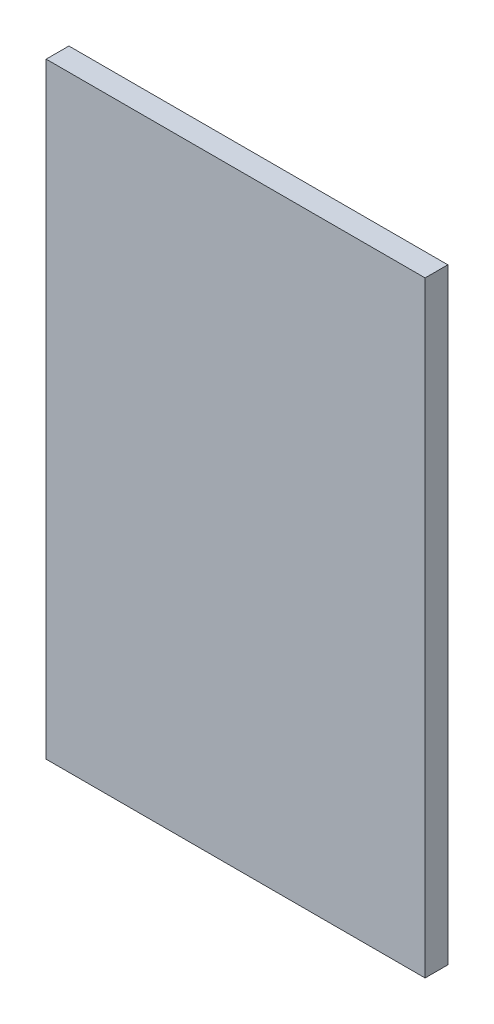
ISO-10303-21;
HEADER;
FILE_DESCRIPTION(('STEP AP214'),'2;1');
FILE_NAME('part.step','',(''),(''),'','','');
FILE_SCHEMA(('AUTOMOTIVE_DESIGN { 1 0 10303 214 1 1 1 1 }'));
ENDSEC;
DATA;
#1=APPLICATION_CONTEXT('core data for automotive mechanical design processes');
#2=APPLICATION_PROTOCOL_DEFINITION('international standard','automotive_design',2000,#1);
#3=PRODUCT_CONTEXT('',#1,'mechanical');
#4=PRODUCT('Part','Part','',(#3));
#5=PRODUCT_RELATED_PRODUCT_CATEGORY('part','',(#4));
#6=PRODUCT_DEFINITION_FORMATION('','',#4);
#7=PRODUCT_DEFINITION_CONTEXT('part definition',#1,'design');
#8=PRODUCT_DEFINITION('design','',#6,#7);
#9=PRODUCT_DEFINITION_SHAPE('','',#8);
#10=(LENGTH_UNIT() NAMED_UNIT(*) SI_UNIT(.MILLI.,.METRE.));
#11=(NAMED_UNIT(*) PLANE_ANGLE_UNIT() SI_UNIT($,.RADIAN.));
#12=(NAMED_UNIT(*) SI_UNIT($,.STERADIAN.) SOLID_ANGLE_UNIT());
#13=UNCERTAINTY_MEASURE_WITH_UNIT(LENGTH_MEASURE(1.E-05),#10,'distance_accuracy_value','');
#14=(GEOMETRIC_REPRESENTATION_CONTEXT(3) GLOBAL_UNCERTAINTY_ASSIGNED_CONTEXT((#13)) GLOBAL_UNIT_ASSIGNED_CONTEXT((#10,
#11,#12)) REPRESENTATION_CONTEXT('',''));
#15=CARTESIAN_POINT('',(0.,0.,0.));
#16=DIRECTION('',(0.,0.,1.));
#17=DIRECTION('',(1.,0.,0.));
#18=AXIS2_PLACEMENT_3D('',#15,#16,#17);
#19=CARTESIAN_POINT('',(250.,800.,-15.));
#20=DIRECTION('',(-1.,0.,0.));
#21=DIRECTION('',(0.,0.,1.));
#22=AXIS2_PLACEMENT_3D('',#19,#20,#21);
#23=PLANE('',#22);
#24=DIRECTION('',(0.,0.,-1.));
#25=VECTOR('',#24,1.);
#26=CARTESIAN_POINT('',(250.,0.,-15.));
#27=LINE('',#26,#25);
#28=CARTESIAN_POINT('',(250.,0.,15.));
#29=VERTEX_POINT('',#28);
#30=CARTESIAN_POINT('',(250.,0.,-15.));
#31=VERTEX_POINT('',#30);
#32=EDGE_CURVE('E102',#29,#31,#27,.T.);
#33=ORIENTED_EDGE('',*,*,#32,.T.);
#34=DIRECTION('',(0.,-1.,0.));
#35=VECTOR('',#34,1.);
#36=CARTESIAN_POINT('',(250.,800.,-15.));
#37=LINE('',#36,#35);
#38=CARTESIAN_POINT('',(250.,800.,-15.));
#39=VERTEX_POINT('',#38);
#40=EDGE_CURVE('E11',#39,#31,#37,.T.);
#41=ORIENTED_EDGE('',*,*,#40,.F.);
#42=DIRECTION('',(0.,0.,-1.));
#43=VECTOR('',#42,1.);
#44=CARTESIAN_POINT('',(250.,800.,-15.));
#45=LINE('',#44,#43);
#46=CARTESIAN_POINT('',(250.,800.,15.));
#47=VERTEX_POINT('',#46);
#48=EDGE_CURVE('E90',#47,#39,#45,.T.);
#49=ORIENTED_EDGE('',*,*,#48,.F.);
#50=DIRECTION('',(0.,-1.,0.));
#51=VECTOR('',#50,1.);
#52=CARTESIAN_POINT('',(250.,800.,15.));
#53=LINE('',#52,#51);
#54=EDGE_CURVE('E98',#47,#29,#53,.T.);
#55=ORIENTED_EDGE('',*,*,#54,.T.);
#56=EDGE_LOOP('',(#33,#41,#49,#55));
#57=FACE_BOUND('',#56,.T.);
#58=ADVANCED_FACE('F39',(#57),#23,.F.);
#59=CARTESIAN_POINT('',(-250.,800.,-15.));
#60=DIRECTION('',(0.,0.,1.));
#61=DIRECTION('',(1.,0.,0.));
#62=AXIS2_PLACEMENT_3D('',#59,#60,#61);
#63=PLANE('',#62);
#64=DIRECTION('',(-1.,0.,0.));
#65=VECTOR('',#64,1.);
#66=CARTESIAN_POINT('',(-250.,0.,-15.));
#67=LINE('',#66,#65);
#68=CARTESIAN_POINT('',(-250.,0.,-15.));
#69=VERTEX_POINT('',#68);
#70=EDGE_CURVE('E94',#31,#69,#67,.T.);
#71=ORIENTED_EDGE('',*,*,#70,.T.);
#72=DIRECTION('',(0.,-1.,0.));
#73=VECTOR('',#72,1.);
#74=CARTESIAN_POINT('',(-250.,800.,-15.));
#75=LINE('',#74,#73);
#76=CARTESIAN_POINT('',(-250.,800.,-15.));
#77=VERTEX_POINT('',#76);
#78=EDGE_CURVE('E47',#77,#69,#75,.T.);
#79=ORIENTED_EDGE('',*,*,#78,.F.);
#80=DIRECTION('',(-1.,0.,0.));
#81=VECTOR('',#80,1.);
#82=CARTESIAN_POINT('',(-250.,800.,-15.));
#83=LINE('',#82,#81);
#84=EDGE_CURVE('E85',#39,#77,#83,.T.);
#85=ORIENTED_EDGE('',*,*,#84,.F.);
#86=ORIENTED_EDGE('',*,*,#40,.T.);
#87=EDGE_LOOP('',(#71,#79,#85,#86));
#88=FACE_BOUND('',#87,.T.);
#89=ADVANCED_FACE('F93',(#88),#63,.F.);
#90=CARTESIAN_POINT('',(-250.,800.,-15.));
#91=DIRECTION('',(1.,0.,0.));
#92=DIRECTION('',(0.,0.,-1.));
#93=AXIS2_PLACEMENT_3D('',#90,#91,#92);
#94=PLANE('',#93);
#95=DIRECTION('',(0.,0.,1.));
#96=VECTOR('',#95,1.);
#97=CARTESIAN_POINT('',(-250.,0.,-15.));
#98=LINE('',#97,#96);
#99=CARTESIAN_POINT('',(-250.,0.,15.));
#100=VERTEX_POINT('',#99);
#101=EDGE_CURVE('E72',#69,#100,#98,.T.);
#102=ORIENTED_EDGE('',*,*,#101,.T.);
#103=DIRECTION('',(0.,-1.,0.));
#104=VECTOR('',#103,1.);
#105=CARTESIAN_POINT('',(-250.,800.,15.));
#106=LINE('',#105,#104);
#107=CARTESIAN_POINT('',(-250.,800.,15.));
#108=VERTEX_POINT('',#107);
#109=EDGE_CURVE('E95',#108,#100,#106,.T.);
#110=ORIENTED_EDGE('',*,*,#109,.F.);
#111=DIRECTION('',(0.,0.,1.));
#112=VECTOR('',#111,1.);
#113=CARTESIAN_POINT('',(-250.,800.,-15.));
#114=LINE('',#113,#112);
#115=EDGE_CURVE('E88',#77,#108,#114,.T.);
#116=ORIENTED_EDGE('',*,*,#115,.F.);
#117=ORIENTED_EDGE('',*,*,#78,.T.);
#118=EDGE_LOOP('',(#102,#110,#116,#117));
#119=FACE_BOUND('',#118,.T.);
#120=ADVANCED_FACE('F96',(#119),#94,.F.);
#121=CARTESIAN_POINT('',(-250.,800.,15.));
#122=DIRECTION('',(0.,0.,-1.));
#123=DIRECTION('',(-1.,0.,0.));
#124=AXIS2_PLACEMENT_3D('',#121,#122,#123);
#125=PLANE('',#124);
#126=DIRECTION('',(1.,0.,0.));
#127=VECTOR('',#126,1.);
#128=CARTESIAN_POINT('',(-250.,0.,15.));
#129=LINE('',#128,#127);
#130=EDGE_CURVE('E78',#100,#29,#129,.T.);
#131=ORIENTED_EDGE('',*,*,#130,.T.);
#132=ORIENTED_EDGE('',*,*,#54,.F.);
#133=DIRECTION('',(1.,0.,0.));
#134=VECTOR('',#133,1.);
#135=CARTESIAN_POINT('',(-250.,800.,15.));
#136=LINE('',#135,#134);
#137=EDGE_CURVE('E55',#108,#47,#136,.T.);
#138=ORIENTED_EDGE('',*,*,#137,.F.);
#139=ORIENTED_EDGE('',*,*,#109,.T.);
#140=EDGE_LOOP('',(#131,#132,#138,#139));
#141=FACE_BOUND('',#140,.T.);
#142=ADVANCED_FACE('F109',(#141),#125,.F.);
#143=CARTESIAN_POINT('',(0.,800.,0.));
#144=DIRECTION('',(0.,1.,0.));
#145=DIRECTION('',(0.,0.,1.));
#146=AXIS2_PLACEMENT_3D('',#143,#144,#145);
#147=PLANE('',#146);
#148=ORIENTED_EDGE('',*,*,#48,.T.);
#149=ORIENTED_EDGE('',*,*,#84,.T.);
#150=ORIENTED_EDGE('',*,*,#115,.T.);
#151=ORIENTED_EDGE('',*,*,#137,.T.);
#152=EDGE_LOOP('',(#148,#149,#150,#151));
#153=FACE_BOUND('',#152,.T.);
#154=ADVANCED_FACE('F86',(#153),#147,.T.);
#155=CARTESIAN_POINT('',(0.,0.,0.));
#156=DIRECTION('',(0.,1.,0.));
#157=DIRECTION('',(0.,0.,1.));
#158=AXIS2_PLACEMENT_3D('',#155,#156,#157);
#159=PLANE('',#158);
#160=ORIENTED_EDGE('',*,*,#32,.F.);
#161=ORIENTED_EDGE('',*,*,#130,.F.);
#162=ORIENTED_EDGE('',*,*,#101,.F.);
#163=ORIENTED_EDGE('',*,*,#70,.F.);
#164=EDGE_LOOP('',(#160,#161,#162,#163));
#165=FACE_BOUND('',#164,.T.);
#166=ADVANCED_FACE('F112',(#165),#159,.F.);
#167=CLOSED_SHELL('',(#58,#89,#120,#142,#154,#166));
#168=MANIFOLD_SOLID_BREP('B2',#167);
#169=ADVANCED_BREP_SHAPE_REPRESENTATION('',(#18,#168),#14);
#170=SHAPE_DEFINITION_REPRESENTATION(#9,#169);
ENDSEC;
END-ISO-10303-21;
